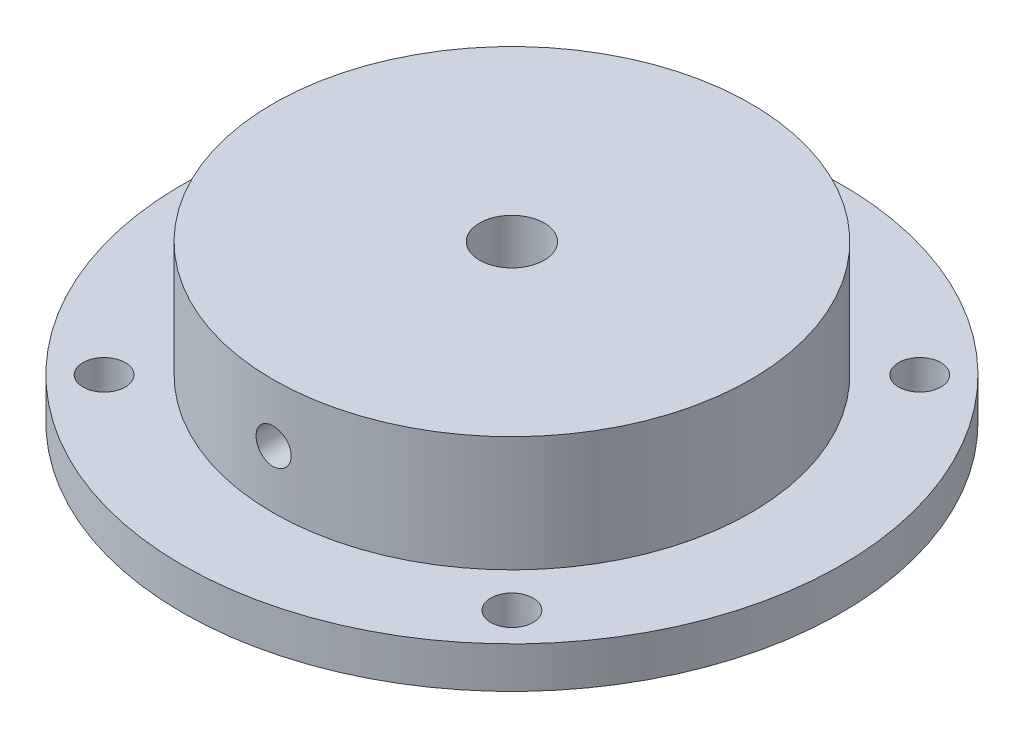
ISO-10303-21;
HEADER;
FILE_DESCRIPTION(('STEP AP214'),'2;1');
FILE_NAME('part.step','',(''),(''),'','','');
FILE_SCHEMA(('AUTOMOTIVE_DESIGN { 1 0 10303 214 1 1 1 1 }'));
ENDSEC;
DATA;
#1=APPLICATION_CONTEXT('core data for automotive mechanical design processes');
#2=APPLICATION_PROTOCOL_DEFINITION('international standard','automotive_design',2000,#1);
#3=PRODUCT_CONTEXT('',#1,'mechanical');
#4=PRODUCT('Part','Part','',(#3));
#5=PRODUCT_RELATED_PRODUCT_CATEGORY('part','',(#4));
#6=PRODUCT_DEFINITION_FORMATION('','',#4);
#7=PRODUCT_DEFINITION_CONTEXT('part definition',#1,'design');
#8=PRODUCT_DEFINITION('design','',#6,#7);
#9=PRODUCT_DEFINITION_SHAPE('','',#8);
#10=(LENGTH_UNIT() NAMED_UNIT(*) SI_UNIT(.MILLI.,.METRE.));
#11=(NAMED_UNIT(*) PLANE_ANGLE_UNIT() SI_UNIT($,.RADIAN.));
#12=(NAMED_UNIT(*) SI_UNIT($,.STERADIAN.) SOLID_ANGLE_UNIT());
#13=UNCERTAINTY_MEASURE_WITH_UNIT(LENGTH_MEASURE(1.E-05),#10,'distance_accuracy_value','');
#14=(GEOMETRIC_REPRESENTATION_CONTEXT(3) GLOBAL_UNCERTAINTY_ASSIGNED_CONTEXT((#13)) GLOBAL_UNIT_ASSIGNED_CONTEXT((#10,
#11,#12)) REPRESENTATION_CONTEXT('',''));
#15=CARTESIAN_POINT('',(0.,0.,0.));
#16=DIRECTION('',(0.,0.,1.));
#17=DIRECTION('',(1.,0.,0.));
#18=AXIS2_PLACEMENT_3D('',#15,#16,#17);
#19=CARTESIAN_POINT('',(0.,3.175,0.));
#20=DIRECTION('',(0.,-1.,0.));
#21=DIRECTION('',(0.,0.,-1.));
#22=AXIS2_PLACEMENT_3D('',#19,#20,#21);
#23=CYLINDRICAL_SURFACE('',#22,25.4);
#24=CARTESIAN_POINT('',(0.,3.175,0.));
#25=DIRECTION('',(0.,1.,0.));
#26=DIRECTION('',(0.,0.,1.));
#27=AXIS2_PLACEMENT_3D('',#24,#25,#26);
#28=CIRCLE('',#27,25.4);
#29=CARTESIAN_POINT('',(0.,3.175,25.4));
#30=VERTEX_POINT('',#29);
#31=EDGE_CURVE('E10',#30,#30,#28,.T.);
#32=ORIENTED_EDGE('',*,*,#31,.F.);
#33=EDGE_LOOP('',(#32));
#34=FACE_BOUND('',#33,.T.);
#35=CARTESIAN_POINT('',(0.,0.,0.));
#36=DIRECTION('',(0.,1.,0.));
#37=DIRECTION('',(0.,0.,1.));
#38=AXIS2_PLACEMENT_3D('',#35,#36,#37);
#39=CIRCLE('',#38,25.4);
#40=CARTESIAN_POINT('',(0.,0.,25.4));
#41=VERTEX_POINT('',#40);
#42=EDGE_CURVE('E45',#41,#41,#39,.T.);
#43=ORIENTED_EDGE('',*,*,#42,.T.);
#44=EDGE_LOOP('',(#43));
#45=FACE_BOUND('',#44,.T.);
#46=ADVANCED_FACE('F34',(#34,#45),#23,.T.);
#47=CARTESIAN_POINT('',(0.,3.175,0.));
#48=DIRECTION('',(0.,1.,0.));
#49=DIRECTION('',(0.,0.,1.));
#50=AXIS2_PLACEMENT_3D('',#47,#48,#49);
#51=PLANE('',#50);
#52=CARTESIAN_POINT('',(15.715448211871,3.175,15.715448211871));
#53=DIRECTION('',(0.,1.,0.));
#54=DIRECTION('',(0.,0.,1.));
#55=AXIS2_PLACEMENT_3D('',#52,#53,#54);
#56=CIRCLE('',#55,1.63194999999999);
#57=CARTESIAN_POINT('',(15.715448211871,3.175,17.347398211871));
#58=VERTEX_POINT('',#57);
#59=EDGE_CURVE('E141',#58,#58,#56,.T.);
#60=ORIENTED_EDGE('',*,*,#59,.F.);
#61=EDGE_LOOP('',(#60));
#62=FACE_BOUND('',#61,.T.);
#63=CARTESIAN_POINT('',(-15.715448211871,3.175,15.715448211871));
#64=DIRECTION('',(0.,1.,0.));
#65=DIRECTION('',(0.,0.,1.));
#66=AXIS2_PLACEMENT_3D('',#63,#64,#65);
#67=CIRCLE('',#66,1.63194999999999);
#68=CARTESIAN_POINT('',(-15.715448211871,3.175,17.347398211871));
#69=VERTEX_POINT('',#68);
#70=EDGE_CURVE('E137',#69,#69,#67,.T.);
#71=ORIENTED_EDGE('',*,*,#70,.F.);
#72=EDGE_LOOP('',(#71));
#73=FACE_BOUND('',#72,.T.);
#74=CARTESIAN_POINT('',(-15.715448211871,3.175,-15.715448211871));
#75=DIRECTION('',(0.,1.,0.));
#76=DIRECTION('',(0.,0.,1.));
#77=AXIS2_PLACEMENT_3D('',#74,#75,#76);
#78=CIRCLE('',#77,1.63194999999999);
#79=CARTESIAN_POINT('',(-15.715448211871,3.175,-14.083498211871));
#80=VERTEX_POINT('',#79);
#81=EDGE_CURVE('E131',#80,#80,#78,.T.);
#82=ORIENTED_EDGE('',*,*,#81,.F.);
#83=EDGE_LOOP('',(#82));
#84=FACE_BOUND('',#83,.T.);
#85=CARTESIAN_POINT('',(15.715448211871,3.175,-15.715448211871));
#86=DIRECTION('',(0.,1.,0.));
#87=DIRECTION('',(0.,0.,1.));
#88=AXIS2_PLACEMENT_3D('',#85,#86,#87);
#89=CIRCLE('',#88,1.63194999999999);
#90=CARTESIAN_POINT('',(15.715448211871,3.175,-14.083498211871));
#91=VERTEX_POINT('',#90);
#92=EDGE_CURVE('E69',#91,#91,#89,.T.);
#93=ORIENTED_EDGE('',*,*,#92,.F.);
#94=EDGE_LOOP('',(#93));
#95=FACE_BOUND('',#94,.T.);
#96=CARTESIAN_POINT('',(0.,3.175,0.));
#97=DIRECTION('',(0.,1.,0.));
#98=DIRECTION('',(0.,0.,1.));
#99=AXIS2_PLACEMENT_3D('',#96,#97,#98);
#100=CIRCLE('',#99,18.415);
#101=CARTESIAN_POINT('',(0.,3.175,18.415));
#102=VERTEX_POINT('',#101);
#103=EDGE_CURVE('E52',#102,#102,#100,.T.);
#104=ORIENTED_EDGE('',*,*,#103,.F.);
#105=EDGE_LOOP('',(#104));
#106=FACE_BOUND('',#105,.T.);
#107=ORIENTED_EDGE('',*,*,#31,.T.);
#108=EDGE_LOOP('',(#107));
#109=FACE_BOUND('',#108,.T.);
#110=ADVANCED_FACE('F98',(#62,#73,#84,#95,#106,#109),#51,.T.);
#111=CARTESIAN_POINT('',(0.,0.,0.));
#112=DIRECTION('',(0.,1.,0.));
#113=DIRECTION('',(0.,0.,1.));
#114=AXIS2_PLACEMENT_3D('',#111,#112,#113);
#115=PLANE('',#114);
#116=CARTESIAN_POINT('',(15.715448211871,0.,15.715448211871));
#117=DIRECTION('',(0.,-1.,0.));
#118=DIRECTION('',(0.,0.,-1.));
#119=AXIS2_PLACEMENT_3D('',#116,#117,#118);
#120=CIRCLE('',#119,1.63194999999999);
#121=CARTESIAN_POINT('',(15.715448211871,0.,14.083498211871));
#122=VERTEX_POINT('',#121);
#123=EDGE_CURVE('E114',#122,#122,#120,.T.);
#124=ORIENTED_EDGE('',*,*,#123,.F.);
#125=EDGE_LOOP('',(#124));
#126=FACE_BOUND('',#125,.T.);
#127=CARTESIAN_POINT('',(-15.715448211871,0.,15.715448211871));
#128=DIRECTION('',(0.,-1.,0.));
#129=DIRECTION('',(0.,0.,-1.));
#130=AXIS2_PLACEMENT_3D('',#127,#128,#129);
#131=CIRCLE('',#130,1.63194999999999);
#132=CARTESIAN_POINT('',(-15.715448211871,0.,14.083498211871));
#133=VERTEX_POINT('',#132);
#134=EDGE_CURVE('E118',#133,#133,#131,.T.);
#135=ORIENTED_EDGE('',*,*,#134,.F.);
#136=EDGE_LOOP('',(#135));
#137=FACE_BOUND('',#136,.T.);
#138=CARTESIAN_POINT('',(-15.715448211871,0.,-15.715448211871));
#139=DIRECTION('',(0.,-1.,0.));
#140=DIRECTION('',(0.,0.,-1.));
#141=AXIS2_PLACEMENT_3D('',#138,#139,#140);
#142=CIRCLE('',#141,1.63194999999999);
#143=CARTESIAN_POINT('',(-15.715448211871,0.,-17.347398211871));
#144=VERTEX_POINT('',#143);
#145=EDGE_CURVE('E122',#144,#144,#142,.T.);
#146=ORIENTED_EDGE('',*,*,#145,.F.);
#147=EDGE_LOOP('',(#146));
#148=FACE_BOUND('',#147,.T.);
#149=CARTESIAN_POINT('',(15.715448211871,0.,-15.715448211871));
#150=DIRECTION('',(0.,-1.,0.));
#151=DIRECTION('',(0.,0.,-1.));
#152=AXIS2_PLACEMENT_3D('',#149,#150,#151);
#153=CIRCLE('',#152,1.63194999999999);
#154=CARTESIAN_POINT('',(15.715448211871,0.,-17.347398211871));
#155=VERTEX_POINT('',#154);
#156=EDGE_CURVE('E126',#155,#155,#153,.T.);
#157=ORIENTED_EDGE('',*,*,#156,.F.);
#158=EDGE_LOOP('',(#157));
#159=FACE_BOUND('',#158,.T.);
#160=CARTESIAN_POINT('',(0.,0.,0.));
#161=DIRECTION('',(0.,1.,0.));
#162=DIRECTION('',(0.,0.,1.));
#163=AXIS2_PLACEMENT_3D('',#160,#161,#162);
#164=CIRCLE('',#163,2.4892);
#165=CARTESIAN_POINT('',(0.,0.,2.4892));
#166=VERTEX_POINT('',#165);
#167=EDGE_CURVE('E55',#166,#166,#164,.T.);
#168=ORIENTED_EDGE('',*,*,#167,.T.);
#169=EDGE_LOOP('',(#168));
#170=FACE_BOUND('',#169,.T.);
#171=ORIENTED_EDGE('',*,*,#42,.F.);
#172=EDGE_LOOP('',(#171));
#173=FACE_BOUND('',#172,.T.);
#174=ADVANCED_FACE('F93',(#126,#137,#148,#159,#170,#173),#115,.F.);
#175=CARTESIAN_POINT('',(0.,12.065,0.));
#176=DIRECTION('',(0.,-1.,0.));
#177=DIRECTION('',(0.,0.,-1.));
#178=AXIS2_PLACEMENT_3D('',#175,#176,#177);
#179=CYLINDRICAL_SURFACE('',#178,18.415);
#180=CARTESIAN_POINT('',(-1.35255,7.62,18.3652615962175));
#181=CARTESIAN_POINT('',(-1.35254667324869,7.69586331050199,18.3652622585377));
#182=CARTESIAN_POINT('',(-1.34614588239744,7.7717790194342,18.3657367187505));
#183=CARTESIAN_POINT('',(-1.32070491357549,7.92151212719887,18.3675833989998));
#184=CARTESIAN_POINT('',(-1.30165021505754,7.99532701370732,18.3689566503864));
#185=CARTESIAN_POINT('',(-1.25145355780686,8.13866803065204,18.3724445358624));
#186=CARTESIAN_POINT('',(-1.22031821070884,8.20819648293678,18.3745587643602));
#187=CARTESIAN_POINT('',(-1.14685530849389,8.34102295619462,18.3792898713083));
#188=CARTESIAN_POINT('',(-1.104530232738,8.40432235311067,18.3819066383735));
#189=CARTESIAN_POINT('',(-1.00979622217114,8.52303939510487,18.3873539419724));
#190=CARTESIAN_POINT('',(-0.957369360579333,8.57844271899893,18.3901848530217));
#191=CARTESIAN_POINT('',(-0.843957549825231,8.67967208741654,18.3957380165563));
#192=CARTESIAN_POINT('',(-0.782972235665779,8.72549772326743,18.3984602644009));
#193=CARTESIAN_POINT('',(-0.654091209210795,8.80631698831384,18.4034927903813));
#194=CARTESIAN_POINT('',(-0.586187853403721,8.84129845987202,18.405802604908));
#195=CARTESIAN_POINT('',(-0.44545172718761,8.89935861093207,18.4097460094622));
#196=CARTESIAN_POINT('',(-0.372619025957564,8.92243745743755,18.4113796089774));
#197=CARTESIAN_POINT('',(-0.224232280407396,8.95599665152316,18.4137839147185));
#198=CARTESIAN_POINT('',(-0.148683431531067,8.96649985757495,18.4145561863859));
#199=CARTESIAN_POINT('',(0.00310859661012197,8.97468025071885,18.4151561118048));
#200=CARTESIAN_POINT('',(0.0793517655375517,8.97235762845848,18.4149837795972));
#201=CARTESIAN_POINT('',(0.230213262752939,8.95497106825203,18.4137152132697));
#202=CARTESIAN_POINT('',(0.304834441360394,8.9399317141282,18.4126207617933));
#203=CARTESIAN_POINT('',(0.450490377744667,8.8975767897358,18.4096331672967));
#204=CARTESIAN_POINT('',(0.521525107918341,8.87026112499847,18.4077400181303));
#205=CARTESIAN_POINT('',(0.658070318098324,8.80410134727081,18.4033650270283));
#206=CARTESIAN_POINT('',(0.723575412269808,8.7652461575006,18.4008826199261));
#207=CARTESIAN_POINT('',(0.847143103587002,8.67711833411986,18.3956082908501));
#208=CARTESIAN_POINT('',(0.905205583998538,8.62784553714578,18.392816364023));
#209=CARTESIAN_POINT('',(1.01238347708563,8.52014246972719,18.3872292074706));
#210=CARTESIAN_POINT('',(1.06147743861575,8.46169084980182,18.384433985514));
#211=CARTESIAN_POINT('',(1.14915914231379,8.33736396548088,18.3791619473192));
#212=CARTESIAN_POINT('',(1.1877468783604,8.27148869676004,18.3766851312665));
#213=CARTESIAN_POINT('',(1.25331958854227,8.13417013591135,18.3723297467562));
#214=CARTESIAN_POINT('',(1.28030355648321,8.06272636155745,18.3704512301824));
#215=CARTESIAN_POINT('',(1.3218874212351,7.91630552238832,18.3675060092211));
#216=CARTESIAN_POINT('',(1.33648751970953,7.84132851513054,18.3664392916138));
#217=CARTESIAN_POINT('',(1.35286226664552,7.69015693547319,18.3652404647005));
#218=CARTESIAN_POINT('',(1.35466678022875,7.61396561454782,18.3651061790968));
#219=CARTESIAN_POINT('',(1.345477262916,7.46236350755746,18.3657816696346));
#220=CARTESIAN_POINT('',(1.33448332441361,7.38695271586171,18.366591438961));
#221=CARTESIAN_POINT('',(1.30003383251902,7.23913738310574,18.3690618063194));
#222=CARTESIAN_POINT('',(1.27659212317696,7.16672959845022,18.3707214590629));
#223=CARTESIAN_POINT('',(1.21792656024579,7.02687537668614,18.3747037874263));
#224=CARTESIAN_POINT('',(1.18270255930721,6.95942900163789,18.3770264713382));
#225=CARTESIAN_POINT('',(1.10139634029233,6.83127522229771,18.3820784171012));
#226=CARTESIAN_POINT('',(1.05529416466073,6.77058050968824,18.3848084228164));
#227=CARTESIAN_POINT('',(0.953569204416953,6.65778101247418,18.3903648326367));
#228=CARTESIAN_POINT('',(0.897946292106689,6.60567634310303,18.3931912380344));
#229=CARTESIAN_POINT('',(0.778629995652756,6.5114345919472,18.3986283953872));
#230=CARTESIAN_POINT('',(0.714921294645707,6.46931687444155,18.4012387221013));
#231=CARTESIAN_POINT('',(0.581318548608257,6.39637727357496,18.4059434883154));
#232=CARTESIAN_POINT('',(0.511424553428428,6.36555529918593,18.4080379319726));
#233=CARTESIAN_POINT('',(0.367505557813339,6.31611558292562,18.4114729538777));
#234=CARTESIAN_POINT('',(0.293484738585048,6.29748572363717,18.4128142804394));
#235=CARTESIAN_POINT('',(0.1433555323735,6.27291944049834,18.4145949493448));
#236=CARTESIAN_POINT('',(0.0672471752321156,6.26698283529043,18.4150343045755));
#237=CARTESIAN_POINT('',(-0.0847054100423964,6.26797349565314,18.4149615580399));
#238=CARTESIAN_POINT('',(-0.160549838249069,6.27487051997418,18.414451693021));
#239=CARTESIAN_POINT('',(-0.31000036495643,6.30126977721424,18.4125422449387));
#240=CARTESIAN_POINT('',(-0.383606459911748,6.32077203009801,18.4111426604661));
#241=CARTESIAN_POINT('',(-0.526494113533272,6.37182086537175,18.407610943451));
#242=CARTESIAN_POINT('',(-0.595775796371724,6.40336710174249,18.4054788319538));
#243=CARTESIAN_POINT('',(-0.728064033290403,6.4776046840557,18.4007210276901));
#244=CARTESIAN_POINT('',(-0.791070718808166,6.52029579648717,18.3980953452654));
#245=CARTESIAN_POINT('',(-0.909174739092622,6.61572430280761,18.3926380726705));
#246=CARTESIAN_POINT('',(-0.964254118359509,6.66848389280607,18.3898060362807));
#247=CARTESIAN_POINT('',(-1.06479552124027,6.78251538892751,18.3842589764997));
#248=CARTESIAN_POINT('',(-1.11025520034196,6.84378936416112,18.3815439817619));
#249=CARTESIAN_POINT('',(-1.19031389290679,6.97320400254798,18.3765337953426));
#250=CARTESIAN_POINT('',(-1.22489599692593,7.04135514134031,18.3742392595628));
#251=CARTESIAN_POINT('',(-1.2820832929911,7.18246531141354,18.3703379576189));
#252=CARTESIAN_POINT('',(-1.3047023865808,7.25541865093337,18.3687303935825));
#253=CARTESIAN_POINT('',(-1.33150035790105,7.37734222264709,18.3668025127521));
#254=CARTESIAN_POINT('',(-1.33938362715936,7.42552620056215,18.3662272873667));
#255=CARTESIAN_POINT('',(-1.3499095124613,7.52246623243099,18.365456616554));
#256=CARTESIAN_POINT('',(-1.3525521389961,7.57122228523935,18.3652611703665));
#257=CARTESIAN_POINT('',(-1.35255,7.62,18.3652615962175));
#258=B_SPLINE_CURVE_WITH_KNOTS('',3,(#180,#181,#182,#183,#184,#185,#186,#187,#188,#189,#190,
#191,#192,#193,#194,#195,#196,#197,#198,#199,#200,#201,#202,#203,#204,#205,#206,#207,#208,#209,
#210,#211,#212,#213,#214,#215,#216,#217,#218,#219,#220,#221,#222,#223,#224,#225,#226,#227,#228,
#229,#230,#231,#232,#233,#234,#235,#236,#237,#238,#239,#240,#241,#242,#243,#244,#245,#246,#247,
#248,#249,#250,#251,#252,#253,#254,#255,#256,#257),.UNSPECIFIED.,.T.,.F.,(4,2,2,2,2,2,2,2,2,2,2,
2,2,2,2,2,2,2,2,2,2,2,2,2,2,2,2,2,2,2,2,2,2,2,2,2,2,2,4),(0.,0.227411849272525,0.45508510899637,
0.682633940468655,0.910132395066739,1.13803835332969,1.36595403418207,1.59412431998186,
1.82229140427787,2.05004312146835,2.27779145328797,2.50510050891645,2.73241131376518,
2.95994102319565,3.18747430089454,3.41554487002724,3.64361557204198,3.87170604670236,
4.09979280698235,4.32734703296956,4.55489961622496,4.78219965052117,5.00950252754021,
5.23722571164109,5.46495195034759,5.6931161946006,5.92127860012418,6.14921389536,
6.37714593390069,6.60454155192705,6.83193753011422,7.05932697579005,7.28671165751212,
7.51460352705461,7.74255087456917,7.97085084004887,8.19888492478922,8.34510386052864,
8.49132250355393),.UNSPECIFIED.);
#259=CARTESIAN_POINT('',(-1.35255,7.62,18.3652615962175));
#260=VERTEX_POINT('',#259);
#261=EDGE_CURVE('E63',#260,#260,#258,.T.);
#262=ORIENTED_EDGE('',*,*,#261,.T.);
#263=EDGE_LOOP('',(#262));
#264=FACE_BOUND('',#263,.T.);
#265=CARTESIAN_POINT('',(0.,12.065,0.));
#266=DIRECTION('',(0.,1.,0.));
#267=DIRECTION('',(0.,0.,1.));
#268=AXIS2_PLACEMENT_3D('',#265,#266,#267);
#269=CIRCLE('',#268,18.415);
#270=CARTESIAN_POINT('',(0.,12.065,18.415));
#271=VERTEX_POINT('',#270);
#272=EDGE_CURVE('E50',#271,#271,#269,.T.);
#273=ORIENTED_EDGE('',*,*,#272,.F.);
#274=EDGE_LOOP('',(#273));
#275=FACE_BOUND('',#274,.T.);
#276=ORIENTED_EDGE('',*,*,#103,.T.);
#277=EDGE_LOOP('',(#276));
#278=FACE_BOUND('',#277,.T.);
#279=ADVANCED_FACE('F71',(#264,#275,#278),#179,.T.);
#280=CARTESIAN_POINT('',(0.,12.065,0.));
#281=DIRECTION('',(0.,1.,0.));
#282=DIRECTION('',(0.,0.,1.));
#283=AXIS2_PLACEMENT_3D('',#280,#281,#282);
#284=PLANE('',#283);
#285=CARTESIAN_POINT('',(0.,12.065,0.));
#286=DIRECTION('',(0.,1.,0.));
#287=DIRECTION('',(0.,0.,1.));
#288=AXIS2_PLACEMENT_3D('',#285,#286,#287);
#289=CIRCLE('',#288,2.48919999999999);
#290=CARTESIAN_POINT('',(0.,12.065,2.48919999999999));
#291=VERTEX_POINT('',#290);
#292=EDGE_CURVE('E60',#291,#291,#289,.T.);
#293=ORIENTED_EDGE('',*,*,#292,.F.);
#294=EDGE_LOOP('',(#293));
#295=FACE_BOUND('',#294,.T.);
#296=ORIENTED_EDGE('',*,*,#272,.T.);
#297=EDGE_LOOP('',(#296));
#298=FACE_BOUND('',#297,.T.);
#299=ADVANCED_FACE('F86',(#295,#298),#284,.T.);
#300=CARTESIAN_POINT('',(0.,12.065,0.));
#301=DIRECTION('',(0.,1.,0.));
#302=DIRECTION('',(0.,0.,1.));
#303=AXIS2_PLACEMENT_3D('',#300,#301,#302);
#304=CYLINDRICAL_SURFACE('',#303,2.48919999999999);
#305=CARTESIAN_POINT('',(0.,6.26745,2.48919999999999));
#306=CARTESIAN_POINT('',(0.0703458169969837,6.26745449949587,2.48919595635754));
#307=CARTESIAN_POINT('',(0.140752247831416,6.27296979869797,2.48618742915147));
#308=CARTESIAN_POINT('',(0.279436492377327,6.29476384630136,2.47444842061267));
#309=CARTESIAN_POINT('',(0.347711095676724,6.31105807898485,2.4657097078438));
#310=CARTESIAN_POINT('',(0.479924429067063,6.35356126552815,2.44341303015242));
#311=CARTESIAN_POINT('',(0.54387965585679,6.37972964796847,2.4298747993201));
#312=CARTESIAN_POINT('',(0.666368684406417,6.44100084137688,2.39917950928813));
#313=CARTESIAN_POINT('',(0.724902334981475,6.47610390139311,2.38202234921553));
#314=CARTESIAN_POINT('',(0.839343982826095,6.55692517831971,2.34424632388435));
#315=CARTESIAN_POINT('',(0.894805672836866,6.60320130594504,2.32347170788974));
#316=CARTESIAN_POINT('',(0.997602059821432,6.70383232237269,2.28122801570182));
#317=CARTESIAN_POINT('',(1.04492935165065,6.75819448920858,2.25975832765445));
#318=CARTESIAN_POINT('',(1.13467890193291,6.87964415295146,2.21615441732712));
#319=CARTESIAN_POINT('',(1.17620008573188,6.9474512911803,2.19415278920114));
#320=CARTESIAN_POINT('',(1.24708580166542,7.0903625596368,2.15465762879415));
#321=CARTESIAN_POINT('',(1.27645987003044,7.16546090840233,2.13716056424356));
#322=CARTESIAN_POINT('',(1.32014787822114,7.3161057717618,2.11043831073532));
#323=CARTESIAN_POINT('',(1.33529366330495,7.3913262980818,2.10076163023955));
#324=CARTESIAN_POINT('',(1.35257211719016,7.54380716494871,2.08968513226561));
#325=CARTESIAN_POINT('',(1.35472252079317,7.62106458097603,2.08827403482427));
#326=CARTESIAN_POINT('',(1.34655566851597,7.76310810901584,2.09353997785434));
#327=CARTESIAN_POINT('',(1.33803125617149,7.82805234094552,2.09905429774383));
#328=CARTESIAN_POINT('',(1.31191962845963,7.9553870026604,2.11547140230956));
#329=CARTESIAN_POINT('',(1.29432848656199,8.01777631333881,2.12637652149652));
#330=CARTESIAN_POINT('',(1.25033539175913,8.13996763395461,2.1525430102513));
#331=CARTESIAN_POINT('',(1.22374841321184,8.19968272452895,2.16789479546866));
#332=CARTESIAN_POINT('',(1.16267509932659,8.31411036407189,2.20125264752762));
#333=CARTESIAN_POINT('',(1.12818531225756,8.36882071245229,2.21925987296445));
#334=CARTESIAN_POINT('',(1.04613935750034,8.48051935870108,2.25922423472035));
#335=CARTESIAN_POINT('',(0.99739039737635,8.53656962663524,2.2813635441025));
#336=CARTESIAN_POINT('',(0.891195920486835,8.64013059117252,2.32490482504709));
#337=CARTESIAN_POINT('',(0.833744760169964,8.68763570201426,2.34630630697565));
#338=CARTESIAN_POINT('',(0.707187142898507,8.77567647046662,2.38761507130813));
#339=CARTESIAN_POINT('',(0.637570073144511,8.81557152104497,2.4073390706066));
#340=CARTESIAN_POINT('',(0.491280414195339,8.88273330442349,2.44138892464724));
#341=CARTESIAN_POINT('',(0.414614404428207,8.91001167293486,2.45571975095056));
#342=CARTESIAN_POINT('',(0.263935156209106,8.94861245988548,2.47622611752603));
#343=CARTESIAN_POINT('',(0.190325251366392,8.96117049560709,2.48302991836545));
#344=CARTESIAN_POINT('',(0.0417459100605424,8.97395640255803,2.48995807190855));
#345=CARTESIAN_POINT('',(-0.0332226631712522,8.97419184595947,2.49008652657913));
#346=CARTESIAN_POINT('',(-0.174786092528664,8.96290784093222,2.48397078085945));
#347=CARTESIAN_POINT('',(-0.241500423618623,8.95250185746619,2.47833021358012));
#348=CARTESIAN_POINT('',(-0.37206787515307,8.92209487695353,2.46211516140844));
#349=CARTESIAN_POINT('',(-0.435920702205787,8.90209289847349,2.45154017184953));
#350=CARTESIAN_POINT('',(-0.56074176166381,8.85270978210242,2.42607531864313));
#351=CARTESIAN_POINT('',(-0.621606939534889,8.82311927455733,2.4110898930041));
#352=CARTESIAN_POINT('',(-0.737673911232848,8.75566707362134,2.37815035291498));
#353=CARTESIAN_POINT('',(-0.792873565409597,8.71780227211762,2.360195123521));
#354=CARTESIAN_POINT('',(-0.902525138791924,8.63009790770534,2.32063029348538));
#355=CARTESIAN_POINT('',(-0.956223165112821,8.57939823618395,2.29883605716541));
#356=CARTESIAN_POINT('',(-1.05475100357994,8.4698969068587,2.25533230550213));
#357=CARTESIAN_POINT('',(-1.09957197489456,8.41108727004905,2.23362289551668));
#358=CARTESIAN_POINT('',(-1.18229194706407,8.28173489836912,2.19103240440704));
#359=CARTESIAN_POINT('',(-1.21944005711636,8.21064748700746,2.17032948269888));
#360=CARTESIAN_POINT('',(-1.28088095748204,8.06180633397442,2.13465150903004));
#361=CARTESIAN_POINT('',(-1.30519235368668,7.98406243154785,2.11966817572003));
#362=CARTESIAN_POINT('',(-1.33784698713277,7.83210864076186,2.09919567379112));
#363=CARTESIAN_POINT('',(-1.34751630478283,7.75829354467204,2.09292308666779));
#364=CARTESIAN_POINT('',(-1.35454654819495,7.60985623325911,2.08838327471234));
#365=CARTESIAN_POINT('',(-1.35191711207562,7.53523469565919,2.09010978125021));
#366=CARTESIAN_POINT('',(-1.33571073597535,7.39766319053361,2.10049030973011));
#367=CARTESIAN_POINT('',(-1.32360383528871,7.33445863858036,2.1082130379484));
#368=CARTESIAN_POINT('',(-1.29084270809285,7.21110973540448,2.12842900854001));
#369=CARTESIAN_POINT('',(-1.27018511916678,7.15096659849225,2.14092412742757));
#370=CARTESIAN_POINT('',(-1.21951270841104,7.03121170241449,2.17020958299422));
#371=CARTESIAN_POINT('',(-1.18899257566019,6.9718694900946,2.18722003668212));
#372=CARTESIAN_POINT('',(-1.11994945402672,6.85875024946921,2.22336419484242));
#373=CARTESIAN_POINT('',(-1.08142218155141,6.80497622314986,2.24249903323767));
#374=CARTESIAN_POINT('',(-0.990634519976389,6.6959875566579,2.28421017437249));
#375=CARTESIAN_POINT('',(-0.937176916293302,6.64179571157878,2.30686758823897));
#376=CARTESIAN_POINT('',(-0.821501964121687,6.54281755957001,2.3505474857472));
#377=CARTESIAN_POINT('',(-0.759278632174307,6.49803772972086,2.37156883727349));
#378=CARTESIAN_POINT('',(-0.625250325457722,6.41803220926805,2.41043391779507));
#379=CARTESIAN_POINT('',(-0.5532114345337,6.38313864162204,2.42816151348504));
#380=CARTESIAN_POINT('',(-0.403095897755135,6.32643798236511,2.45752605778315));
#381=CARTESIAN_POINT('',(-0.325035609046928,6.30459675577082,2.46917888307256));
#382=CARTESIAN_POINT('',(-0.20504953558427,6.28245086835106,2.48107432737666));
#383=CARTESIAN_POINT('',(-0.164310407384179,6.27683717871193,2.4841099095082));
#384=CARTESIAN_POINT('',(-0.0823877842279835,6.26933543032973,2.48817392816235));
#385=CARTESIAN_POINT('',(-0.0412042901208917,6.26744736446969,2.48920236851917));
#386=CARTESIAN_POINT('',(0.,6.26745,2.48919999999999));
#387=B_SPLINE_CURVE_WITH_KNOTS('',3,(#305,#306,#307,#308,#309,#310,#311,#312,#313,#314,#315,
#316,#317,#318,#319,#320,#321,#322,#323,#324,#325,#326,#327,#328,#329,#330,#331,#332,#333,#334,
#335,#336,#337,#338,#339,#340,#341,#342,#343,#344,#345,#346,#347,#348,#349,#350,#351,#352,#353,
#354,#355,#356,#357,#358,#359,#360,#361,#362,#363,#364,#365,#366,#367,#368,#369,#370,#371,#372,
#373,#374,#375,#376,#377,#378,#379,#380,#381,#382,#383,#384,#385,#386),.UNSPECIFIED.,.T.,.F.,(4,
2,2,2,2,2,2,2,2,2,2,2,2,2,2,2,2,2,2,2,2,2,2,2,2,2,2,2,2,2,2,2,2,2,2,2,2,2,2,2,4),(0.,
0.210871428658044,0.422046440595896,0.632363050736528,0.842685523953771,1.06725228635551,
1.29202241245727,1.53827431707237,1.78433253014158,2.01489681200162,2.24514637152159,
2.44142150289883,2.637781706694,2.83845455250317,3.03921521437449,3.27077321966301,
3.50248204304989,3.74901989540454,3.99532992308112,4.21901198366091,4.44255659110442,
4.64488593462337,4.84723597585258,5.05434137494109,5.26152470416746,5.49155801022361,
5.72181927148268,5.96900459708148,6.21583065499286,6.43858468391838,6.66116417728343,
6.8547619074224,7.04843583910172,7.25424807191364,7.46017069316401,7.69738489416197,
7.93476180855907,8.17936065363198,8.42331698273413,8.54683284328739,8.67034846789099),.UNSPECIFIED.);
#388=CARTESIAN_POINT('',(0.,6.26745,2.48919999999999));
#389=VERTEX_POINT('',#388);
#390=EDGE_CURVE('E37',#389,#389,#387,.T.);
#391=ORIENTED_EDGE('',*,*,#390,.T.);
#392=EDGE_LOOP('',(#391));
#393=FACE_BOUND('',#392,.T.);
#394=ORIENTED_EDGE('',*,*,#167,.F.);
#395=EDGE_LOOP('',(#394));
#396=FACE_BOUND('',#395,.T.);
#397=ORIENTED_EDGE('',*,*,#292,.T.);
#398=EDGE_LOOP('',(#397));
#399=FACE_BOUND('',#398,.T.);
#400=ADVANCED_FACE('F80',(#393,#396,#399),#304,.F.);
#401=CARTESIAN_POINT('',(0.,7.62,0.));
#402=DIRECTION('',(0.,0.,-1.));
#403=DIRECTION('',(-1.,0.,0.));
#404=AXIS2_PLACEMENT_3D('',#401,#402,#403);
#405=CYLINDRICAL_SURFACE('',#404,1.35255);
#406=ORIENTED_EDGE('',*,*,#390,.F.);
#407=EDGE_LOOP('',(#406));
#408=FACE_BOUND('',#407,.T.);
#409=ORIENTED_EDGE('',*,*,#261,.F.);
#410=EDGE_LOOP('',(#409));
#411=FACE_BOUND('',#410,.T.);
#412=ADVANCED_FACE('F75',(#408,#411),#405,.F.);
#413=CARTESIAN_POINT('',(15.715448211871,0.,-15.715448211871));
#414=DIRECTION('',(0.,-1.,0.));
#415=DIRECTION('',(0.,0.,-1.));
#416=AXIS2_PLACEMENT_3D('',#413,#414,#415);
#417=CYLINDRICAL_SURFACE('',#416,1.63194999999999);
#418=ORIENTED_EDGE('',*,*,#92,.T.);
#419=EDGE_LOOP('',(#418));
#420=FACE_BOUND('',#419,.T.);
#421=ORIENTED_EDGE('',*,*,#156,.T.);
#422=EDGE_LOOP('',(#421));
#423=FACE_BOUND('',#422,.T.);
#424=ADVANCED_FACE('F79',(#420,#423),#417,.F.);
#425=CARTESIAN_POINT('',(-15.715448211871,0.,-15.715448211871));
#426=DIRECTION('',(0.,-1.,0.));
#427=DIRECTION('',(0.,0.,-1.));
#428=AXIS2_PLACEMENT_3D('',#425,#426,#427);
#429=CYLINDRICAL_SURFACE('',#428,1.63194999999999);
#430=ORIENTED_EDGE('',*,*,#81,.T.);
#431=EDGE_LOOP('',(#430));
#432=FACE_BOUND('',#431,.T.);
#433=ORIENTED_EDGE('',*,*,#145,.T.);
#434=EDGE_LOOP('',(#433));
#435=FACE_BOUND('',#434,.T.);
#436=ADVANCED_FACE('F153',(#432,#435),#429,.F.);
#437=CARTESIAN_POINT('',(-15.715448211871,0.,15.715448211871));
#438=DIRECTION('',(0.,-1.,0.));
#439=DIRECTION('',(0.,0.,-1.));
#440=AXIS2_PLACEMENT_3D('',#437,#438,#439);
#441=CYLINDRICAL_SURFACE('',#440,1.63194999999999);
#442=ORIENTED_EDGE('',*,*,#70,.T.);
#443=EDGE_LOOP('',(#442));
#444=FACE_BOUND('',#443,.T.);
#445=ORIENTED_EDGE('',*,*,#134,.T.);
#446=EDGE_LOOP('',(#445));
#447=FACE_BOUND('',#446,.T.);
#448=ADVANCED_FACE('F147',(#444,#447),#441,.F.);
#449=CARTESIAN_POINT('',(15.715448211871,0.,15.715448211871));
#450=DIRECTION('',(0.,-1.,0.));
#451=DIRECTION('',(0.,0.,-1.));
#452=AXIS2_PLACEMENT_3D('',#449,#450,#451);
#453=CYLINDRICAL_SURFACE('',#452,1.63194999999999);
#454=ORIENTED_EDGE('',*,*,#59,.T.);
#455=EDGE_LOOP('',(#454));
#456=FACE_BOUND('',#455,.T.);
#457=ORIENTED_EDGE('',*,*,#123,.T.);
#458=EDGE_LOOP('',(#457));
#459=FACE_BOUND('',#458,.T.);
#460=ADVANCED_FACE('F145',(#456,#459),#453,.F.);
#461=CLOSED_SHELL('',(#46,#110,#174,#279,#299,#400,#412,#424,#436,#448,#460));
#462=MANIFOLD_SOLID_BREP('B2',#461);
#463=ADVANCED_BREP_SHAPE_REPRESENTATION('',(#18,#462),#14);
#464=SHAPE_DEFINITION_REPRESENTATION(#9,#463);
ENDSEC;
END-ISO-10303-21;
